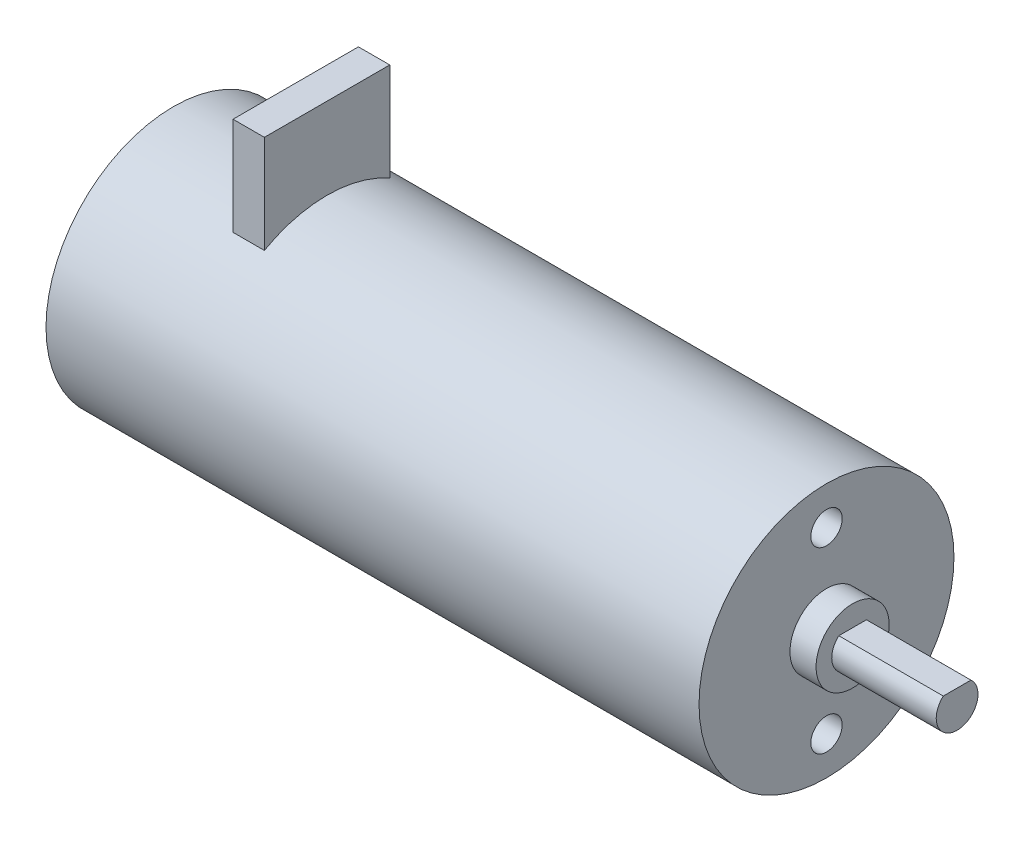
ISO-10303-21;
HEADER;
FILE_DESCRIPTION(('STEP AP214'),'2;1');
FILE_NAME('part.step','',(''),(''),'','','');
FILE_SCHEMA(('AUTOMOTIVE_DESIGN { 1 0 10303 214 1 1 1 1 }'));
ENDSEC;
DATA;
#1=APPLICATION_CONTEXT('core data for automotive mechanical design processes');
#2=APPLICATION_PROTOCOL_DEFINITION('international standard','automotive_design',2000,#1);
#3=PRODUCT_CONTEXT('',#1,'mechanical');
#4=PRODUCT('Part','Part','',(#3));
#5=PRODUCT_RELATED_PRODUCT_CATEGORY('part','',(#4));
#6=PRODUCT_DEFINITION_FORMATION('','',#4);
#7=PRODUCT_DEFINITION_CONTEXT('part definition',#1,'design');
#8=PRODUCT_DEFINITION('design','',#6,#7);
#9=PRODUCT_DEFINITION_SHAPE('','',#8);
#10=(LENGTH_UNIT() NAMED_UNIT(*) SI_UNIT(.MILLI.,.METRE.));
#11=(NAMED_UNIT(*) PLANE_ANGLE_UNIT() SI_UNIT($,.RADIAN.));
#12=(NAMED_UNIT(*) SI_UNIT($,.STERADIAN.) SOLID_ANGLE_UNIT());
#13=UNCERTAINTY_MEASURE_WITH_UNIT(LENGTH_MEASURE(1.E-05),#10,'distance_accuracy_value','');
#14=(GEOMETRIC_REPRESENTATION_CONTEXT(3) GLOBAL_UNCERTAINTY_ASSIGNED_CONTEXT((#13)) GLOBAL_UNIT_ASSIGNED_CONTEXT((#10,
#11,#12)) REPRESENTATION_CONTEXT('',''));
#15=CARTESIAN_POINT('',(0.,0.,0.));
#16=DIRECTION('',(0.,0.,1.));
#17=DIRECTION('',(1.,0.,0.));
#18=AXIS2_PLACEMENT_3D('',#15,#16,#17);
#19=CARTESIAN_POINT('',(62.5,0.,0.));
#20=DIRECTION('',(-1.,0.,0.));
#21=DIRECTION('',(0.,0.,1.));
#22=AXIS2_PLACEMENT_3D('',#19,#20,#21);
#23=CYLINDRICAL_SURFACE('',#22,12.2);
#24=CARTESIAN_POINT('',(0.,0.,0.));
#25=DIRECTION('',(1.,0.,0.));
#26=DIRECTION('',(0.,0.,-1.));
#27=AXIS2_PLACEMENT_3D('',#24,#25,#26);
#28=CIRCLE('',#27,12.2);
#29=CARTESIAN_POINT('',(0.,0.,-12.2));
#30=VERTEX_POINT('',#29);
#31=EDGE_CURVE('E143',#30,#30,#28,.T.);
#32=ORIENTED_EDGE('',*,*,#31,.T.);
#33=EDGE_LOOP('',(#32));
#34=FACE_BOUND('',#33,.T.);
#35=CARTESIAN_POINT('',(62.5,0.,0.));
#36=DIRECTION('',(1.,0.,0.));
#37=DIRECTION('',(0.,0.,-1.));
#38=AXIS2_PLACEMENT_3D('',#35,#36,#37);
#39=CIRCLE('',#38,12.2);
#40=CARTESIAN_POINT('',(62.5,0.,-12.2));
#41=VERTEX_POINT('',#40);
#42=EDGE_CURVE('E148',#41,#41,#39,.T.);
#43=ORIENTED_EDGE('',*,*,#42,.F.);
#44=EDGE_LOOP('',(#43));
#45=FACE_BOUND('',#44,.T.);
#46=CARTESIAN_POINT('',(11.7,0.,0.));
#47=DIRECTION('',(1.,0.,0.));
#48=DIRECTION('',(0.,0.,-1.));
#49=AXIS2_PLACEMENT_3D('',#46,#47,#48);
#50=CIRCLE('',#49,12.2);
#51=CARTESIAN_POINT('',(11.7,10.6226173799116,-6.));
#52=VERTEX_POINT('',#51);
#53=CARTESIAN_POINT('',(11.7,10.6226173799116,6.));
#54=VERTEX_POINT('',#53);
#55=EDGE_CURVE('E11',#52,#54,#50,.T.);
#56=ORIENTED_EDGE('',*,*,#55,.F.);
#57=DIRECTION('',(-1.,0.,0.));
#58=VECTOR('',#57,1.);
#59=CARTESIAN_POINT('',(62.5,10.6226173799116,-6.));
#60=LINE('',#59,#58);
#61=CARTESIAN_POINT('',(14.7,10.6226173799116,-6.));
#62=VERTEX_POINT('',#61);
#63=EDGE_CURVE('E147',#62,#52,#60,.T.);
#64=ORIENTED_EDGE('',*,*,#63,.F.);
#65=CARTESIAN_POINT('',(14.7,0.,0.));
#66=DIRECTION('',(-1.,0.,0.));
#67=DIRECTION('',(0.,0.,1.));
#68=AXIS2_PLACEMENT_3D('',#65,#66,#67);
#69=CIRCLE('',#68,12.2);
#70=CARTESIAN_POINT('',(14.7,10.6226173799116,6.));
#71=VERTEX_POINT('',#70);
#72=EDGE_CURVE('E54',#71,#62,#69,.T.);
#73=ORIENTED_EDGE('',*,*,#72,.F.);
#74=DIRECTION('',(-1.,0.,0.));
#75=VECTOR('',#74,1.);
#76=CARTESIAN_POINT('',(62.5,10.6226173799116,6.));
#77=LINE('',#76,#75);
#78=EDGE_CURVE('E44',#54,#71,#77,.F.);
#79=ORIENTED_EDGE('',*,*,#78,.F.);
#80=EDGE_LOOP('',(#56,#64,#73,#79));
#81=FACE_BOUND('',#80,.T.);
#82=ADVANCED_FACE('F37',(#34,#45,#81),#23,.T.);
#83=CARTESIAN_POINT('',(62.5,0.,0.));
#84=DIRECTION('',(1.,0.,0.));
#85=DIRECTION('',(0.,0.,-1.));
#86=AXIS2_PLACEMENT_3D('',#83,#84,#85);
#87=PLANE('',#86);
#88=CARTESIAN_POINT('',(62.5,8.55,0.));
#89=DIRECTION('',(1.,0.,0.));
#90=DIRECTION('',(0.,0.,-1.));
#91=AXIS2_PLACEMENT_3D('',#88,#89,#90);
#92=CIRCLE('',#91,1.5);
#93=CARTESIAN_POINT('',(62.5,8.55,-1.5));
#94=VERTEX_POINT('',#93);
#95=EDGE_CURVE('E119',#94,#94,#92,.T.);
#96=ORIENTED_EDGE('',*,*,#95,.F.);
#97=EDGE_LOOP('',(#96));
#98=FACE_BOUND('',#97,.T.);
#99=CARTESIAN_POINT('',(62.5,-8.55,0.));
#100=DIRECTION('',(1.,0.,0.));
#101=DIRECTION('',(0.,0.,1.));
#102=AXIS2_PLACEMENT_3D('',#99,#100,#101);
#103=CIRCLE('',#102,1.5);
#104=CARTESIAN_POINT('',(62.5,-8.55,1.5));
#105=VERTEX_POINT('',#104);
#106=EDGE_CURVE('E106',#105,#105,#103,.T.);
#107=ORIENTED_EDGE('',*,*,#106,.F.);
#108=EDGE_LOOP('',(#107));
#109=FACE_BOUND('',#108,.T.);
#110=CARTESIAN_POINT('',(62.5,0.,0.));
#111=DIRECTION('',(1.,0.,0.));
#112=DIRECTION('',(0.,0.,-1.));
#113=AXIS2_PLACEMENT_3D('',#110,#111,#112);
#114=CIRCLE('',#113,3.5);
#115=CARTESIAN_POINT('',(62.5,0.,-3.5));
#116=VERTEX_POINT('',#115);
#117=EDGE_CURVE('E144',#116,#116,#114,.T.);
#118=ORIENTED_EDGE('',*,*,#117,.F.);
#119=EDGE_LOOP('',(#118));
#120=FACE_BOUND('',#119,.T.);
#121=ORIENTED_EDGE('',*,*,#42,.T.);
#122=EDGE_LOOP('',(#121));
#123=FACE_BOUND('',#122,.T.);
#124=ADVANCED_FACE('F166',(#98,#109,#120,#123),#87,.T.);
#125=CARTESIAN_POINT('',(0.,0.,0.));
#126=DIRECTION('',(1.,0.,0.));
#127=DIRECTION('',(0.,0.,-1.));
#128=AXIS2_PLACEMENT_3D('',#125,#126,#127);
#129=PLANE('',#128);
#130=ORIENTED_EDGE('',*,*,#31,.F.);
#131=EDGE_LOOP('',(#130));
#132=FACE_BOUND('',#131,.T.);
#133=ADVANCED_FACE('F171',(#132),#129,.F.);
#134=CARTESIAN_POINT('',(65.,0.,0.));
#135=DIRECTION('',(-1.,0.,0.));
#136=DIRECTION('',(0.,0.,1.));
#137=AXIS2_PLACEMENT_3D('',#134,#135,#136);
#138=CYLINDRICAL_SURFACE('',#137,3.5);
#139=CARTESIAN_POINT('',(65.,0.,0.));
#140=DIRECTION('',(1.,0.,0.));
#141=DIRECTION('',(0.,0.,-1.));
#142=AXIS2_PLACEMENT_3D('',#139,#140,#141);
#143=CIRCLE('',#142,3.5);
#144=CARTESIAN_POINT('',(65.,0.,-3.5));
#145=VERTEX_POINT('',#144);
#146=EDGE_CURVE('E140',#145,#145,#143,.T.);
#147=ORIENTED_EDGE('',*,*,#146,.F.);
#148=EDGE_LOOP('',(#147));
#149=FACE_BOUND('',#148,.T.);
#150=ORIENTED_EDGE('',*,*,#117,.T.);
#151=EDGE_LOOP('',(#150));
#152=FACE_BOUND('',#151,.T.);
#153=ADVANCED_FACE('F180',(#149,#152),#138,.T.);
#154=CARTESIAN_POINT('',(65.,0.,0.));
#155=DIRECTION('',(1.,0.,0.));
#156=DIRECTION('',(0.,0.,-1.));
#157=AXIS2_PLACEMENT_3D('',#154,#155,#156);
#158=PLANE('',#157);
#159=CARTESIAN_POINT('',(65.,0.,0.));
#160=DIRECTION('',(1.,0.,0.));
#161=DIRECTION('',(0.,0.,-1.));
#162=AXIS2_PLACEMENT_3D('',#159,#160,#161);
#163=CIRCLE('',#162,2.);
#164=CARTESIAN_POINT('',(65.,1.5,1.3228756555323));
#165=VERTEX_POINT('',#164);
#166=CARTESIAN_POINT('',(65.,1.5,-1.3228756555323));
#167=VERTEX_POINT('',#166);
#168=EDGE_CURVE('E118',#165,#167,#163,.T.);
#169=ORIENTED_EDGE('',*,*,#168,.F.);
#170=DIRECTION('',(0.,0.,1.));
#171=VECTOR('',#170,1.);
#172=CARTESIAN_POINT('',(65.,1.5,1.3228756555323));
#173=LINE('',#172,#171);
#174=EDGE_CURVE('E128',#167,#165,#173,.T.);
#175=ORIENTED_EDGE('',*,*,#174,.F.);
#176=EDGE_LOOP('',(#169,#175));
#177=FACE_BOUND('',#176,.T.);
#178=ORIENTED_EDGE('',*,*,#146,.T.);
#179=EDGE_LOOP('',(#178));
#180=FACE_BOUND('',#179,.T.);
#181=ADVANCED_FACE('F184',(#177,#180),#158,.T.);
#182=CARTESIAN_POINT('',(75.,0.,0.));
#183=DIRECTION('',(-1.,0.,0.));
#184=DIRECTION('',(0.,0.,1.));
#185=AXIS2_PLACEMENT_3D('',#182,#183,#184);
#186=CYLINDRICAL_SURFACE('',#185,2.);
#187=ORIENTED_EDGE('',*,*,#168,.T.);
#188=DIRECTION('',(-1.,0.,0.));
#189=VECTOR('',#188,1.);
#190=CARTESIAN_POINT('',(75.,1.5,-1.3228756555323));
#191=LINE('',#190,#189);
#192=CARTESIAN_POINT('',(75.,1.5,-1.3228756555323));
#193=VERTEX_POINT('',#192);
#194=EDGE_CURVE('E137',#193,#167,#191,.T.);
#195=ORIENTED_EDGE('',*,*,#194,.F.);
#196=CARTESIAN_POINT('',(75.,0.,0.));
#197=DIRECTION('',(1.,0.,0.));
#198=DIRECTION('',(0.,0.,-1.));
#199=AXIS2_PLACEMENT_3D('',#196,#197,#198);
#200=CIRCLE('',#199,2.);
#201=CARTESIAN_POINT('',(75.,1.5,1.3228756555323));
#202=VERTEX_POINT('',#201);
#203=EDGE_CURVE('E124',#202,#193,#200,.T.);
#204=ORIENTED_EDGE('',*,*,#203,.F.);
#205=DIRECTION('',(-1.,0.,0.));
#206=VECTOR('',#205,1.);
#207=CARTESIAN_POINT('',(75.,1.5,1.3228756555323));
#208=LINE('',#207,#206);
#209=EDGE_CURVE('E130',#202,#165,#208,.T.);
#210=ORIENTED_EDGE('',*,*,#209,.T.);
#211=EDGE_LOOP('',(#187,#195,#204,#210));
#212=FACE_BOUND('',#211,.T.);
#213=ADVANCED_FACE('F190',(#212),#186,.T.);
#214=CARTESIAN_POINT('',(75.,1.5,1.3228756555323));
#215=DIRECTION('',(0.,-1.,0.));
#216=DIRECTION('',(0.,0.,-1.));
#217=AXIS2_PLACEMENT_3D('',#214,#215,#216);
#218=PLANE('',#217);
#219=ORIENTED_EDGE('',*,*,#174,.T.);
#220=ORIENTED_EDGE('',*,*,#209,.F.);
#221=DIRECTION('',(0.,0.,1.));
#222=VECTOR('',#221,1.);
#223=CARTESIAN_POINT('',(75.,1.5,1.3228756555323));
#224=LINE('',#223,#222);
#225=EDGE_CURVE('E127',#193,#202,#224,.T.);
#226=ORIENTED_EDGE('',*,*,#225,.F.);
#227=ORIENTED_EDGE('',*,*,#194,.T.);
#228=EDGE_LOOP('',(#219,#220,#226,#227));
#229=FACE_BOUND('',#228,.T.);
#230=ADVANCED_FACE('F194',(#229),#218,.F.);
#231=CARTESIAN_POINT('',(75.,0.,0.));
#232=DIRECTION('',(1.,0.,0.));
#233=DIRECTION('',(0.,0.,-1.));
#234=AXIS2_PLACEMENT_3D('',#231,#232,#233);
#235=PLANE('',#234);
#236=ORIENTED_EDGE('',*,*,#203,.T.);
#237=ORIENTED_EDGE('',*,*,#225,.T.);
#238=EDGE_LOOP('',(#236,#237));
#239=FACE_BOUND('',#238,.T.);
#240=ADVANCED_FACE('F198',(#239),#235,.T.);
#241=CARTESIAN_POINT('',(57.5,-8.55,0.));
#242=DIRECTION('',(1.,0.,0.));
#243=DIRECTION('',(0.,0.,-1.));
#244=AXIS2_PLACEMENT_3D('',#241,#242,#243);
#245=CYLINDRICAL_SURFACE('',#244,1.5);
#246=CARTESIAN_POINT('',(57.5,-8.55,0.));
#247=DIRECTION('',(1.,0.,0.));
#248=DIRECTION('',(0.,0.,1.));
#249=AXIS2_PLACEMENT_3D('',#246,#247,#248);
#250=CIRCLE('',#249,1.5);
#251=CARTESIAN_POINT('',(57.5,-8.55,1.5));
#252=VERTEX_POINT('',#251);
#253=EDGE_CURVE('E109',#252,#252,#250,.T.);
#254=ORIENTED_EDGE('',*,*,#253,.F.);
#255=EDGE_LOOP('',(#254));
#256=FACE_BOUND('',#255,.T.);
#257=ORIENTED_EDGE('',*,*,#106,.T.);
#258=EDGE_LOOP('',(#257));
#259=FACE_BOUND('',#258,.T.);
#260=ADVANCED_FACE('F202',(#256,#259),#245,.F.);
#261=CARTESIAN_POINT('',(57.5,-8.55,0.));
#262=DIRECTION('',(-1.,0.,0.));
#263=DIRECTION('',(0.,0.,1.));
#264=AXIS2_PLACEMENT_3D('',#261,#262,#263);
#265=PLANE('',#264);
#266=ORIENTED_EDGE('',*,*,#253,.T.);
#267=EDGE_LOOP('',(#266));
#268=FACE_BOUND('',#267,.T.);
#269=ADVANCED_FACE('F206',(#268),#265,.F.);
#270=CARTESIAN_POINT('',(57.5,8.55,0.));
#271=DIRECTION('',(1.,0.,0.));
#272=DIRECTION('',(0.,0.,-1.));
#273=AXIS2_PLACEMENT_3D('',#270,#271,#272);
#274=CYLINDRICAL_SURFACE('',#273,1.5);
#275=CARTESIAN_POINT('',(57.5,8.55,0.));
#276=DIRECTION('',(1.,0.,0.));
#277=DIRECTION('',(0.,0.,-1.));
#278=AXIS2_PLACEMENT_3D('',#275,#276,#277);
#279=CIRCLE('',#278,1.5);
#280=CARTESIAN_POINT('',(57.5,8.55,-1.5));
#281=VERTEX_POINT('',#280);
#282=EDGE_CURVE('E115',#281,#281,#279,.T.);
#283=ORIENTED_EDGE('',*,*,#282,.F.);
#284=EDGE_LOOP('',(#283));
#285=FACE_BOUND('',#284,.T.);
#286=ORIENTED_EDGE('',*,*,#95,.T.);
#287=EDGE_LOOP('',(#286));
#288=FACE_BOUND('',#287,.T.);
#289=ADVANCED_FACE('F210',(#285,#288),#274,.F.);
#290=CARTESIAN_POINT('',(57.5,8.55,0.));
#291=DIRECTION('',(1.,0.,0.));
#292=DIRECTION('',(0.,0.,-1.));
#293=AXIS2_PLACEMENT_3D('',#290,#291,#292);
#294=PLANE('',#293);
#295=ORIENTED_EDGE('',*,*,#282,.T.);
#296=EDGE_LOOP('',(#295));
#297=FACE_BOUND('',#296,.T.);
#298=ADVANCED_FACE('F214',(#297),#294,.T.);
#299=CARTESIAN_POINT('',(11.7,20.,6.));
#300=DIRECTION('',(0.,0.,-1.));
#301=DIRECTION('',(-1.,0.,0.));
#302=AXIS2_PLACEMENT_3D('',#299,#300,#301);
#303=PLANE('',#302);
#304=DIRECTION('',(0.,-1.,0.));
#305=VECTOR('',#304,1.);
#306=CARTESIAN_POINT('',(11.7,20.,6.));
#307=LINE('',#306,#305);
#308=CARTESIAN_POINT('',(11.7,20.,6.));
#309=VERTEX_POINT('',#308);
#310=EDGE_CURVE('E89',#309,#54,#307,.T.);
#311=ORIENTED_EDGE('',*,*,#310,.T.);
#312=ORIENTED_EDGE('',*,*,#78,.T.);
#313=DIRECTION('',(0.,-1.,0.));
#314=VECTOR('',#313,1.);
#315=CARTESIAN_POINT('',(14.7,20.,6.));
#316=LINE('',#315,#314);
#317=CARTESIAN_POINT('',(14.7,20.,6.));
#318=VERTEX_POINT('',#317);
#319=EDGE_CURVE('E91',#318,#71,#316,.T.);
#320=ORIENTED_EDGE('',*,*,#319,.F.);
#321=DIRECTION('',(1.,0.,0.));
#322=VECTOR('',#321,1.);
#323=CARTESIAN_POINT('',(11.7,20.,6.));
#324=LINE('',#323,#322);
#325=EDGE_CURVE('E85',#309,#318,#324,.T.);
#326=ORIENTED_EDGE('',*,*,#325,.F.);
#327=EDGE_LOOP('',(#311,#312,#320,#326));
#328=FACE_BOUND('',#327,.T.);
#329=ADVANCED_FACE('F87',(#328),#303,.F.);
#330=CARTESIAN_POINT('',(11.7,20.,-6.));
#331=DIRECTION('',(0.,0.,1.));
#332=DIRECTION('',(1.,0.,0.));
#333=AXIS2_PLACEMENT_3D('',#330,#331,#332);
#334=PLANE('',#333);
#335=DIRECTION('',(0.,-1.,0.));
#336=VECTOR('',#335,1.);
#337=CARTESIAN_POINT('',(14.7,20.,-6.));
#338=LINE('',#337,#336);
#339=CARTESIAN_POINT('',(14.7,20.,-6.));
#340=VERTEX_POINT('',#339);
#341=EDGE_CURVE('E111',#340,#62,#338,.T.);
#342=ORIENTED_EDGE('',*,*,#341,.T.);
#343=ORIENTED_EDGE('',*,*,#63,.T.);
#344=DIRECTION('',(0.,-1.,0.));
#345=VECTOR('',#344,1.);
#346=CARTESIAN_POINT('',(11.7,20.,-6.));
#347=LINE('',#346,#345);
#348=CARTESIAN_POINT('',(11.7,20.,-6.));
#349=VERTEX_POINT('',#348);
#350=EDGE_CURVE('E160',#349,#52,#347,.T.);
#351=ORIENTED_EDGE('',*,*,#350,.F.);
#352=DIRECTION('',(-1.,0.,0.));
#353=VECTOR('',#352,1.);
#354=CARTESIAN_POINT('',(11.7,20.,-6.));
#355=LINE('',#354,#353);
#356=EDGE_CURVE('E100',#340,#349,#355,.T.);
#357=ORIENTED_EDGE('',*,*,#356,.F.);
#358=EDGE_LOOP('',(#342,#343,#351,#357));
#359=FACE_BOUND('',#358,.T.);
#360=ADVANCED_FACE('F164',(#359),#334,.F.);
#361=CARTESIAN_POINT('',(11.7,20.,-6.));
#362=DIRECTION('',(1.,0.,0.));
#363=DIRECTION('',(0.,0.,-1.));
#364=AXIS2_PLACEMENT_3D('',#361,#362,#363);
#365=PLANE('',#364);
#366=ORIENTED_EDGE('',*,*,#350,.T.);
#367=ORIENTED_EDGE('',*,*,#55,.T.);
#368=ORIENTED_EDGE('',*,*,#310,.F.);
#369=DIRECTION('',(0.,0.,1.));
#370=VECTOR('',#369,1.);
#371=CARTESIAN_POINT('',(11.7,20.,-6.));
#372=LINE('',#371,#370);
#373=EDGE_CURVE('E95',#349,#309,#372,.T.);
#374=ORIENTED_EDGE('',*,*,#373,.F.);
#375=EDGE_LOOP('',(#366,#367,#368,#374));
#376=FACE_BOUND('',#375,.T.);
#377=ADVANCED_FACE('F105',(#376),#365,.F.);
#378=CARTESIAN_POINT('',(14.7,20.,-6.));
#379=DIRECTION('',(-1.,0.,0.));
#380=DIRECTION('',(0.,0.,1.));
#381=AXIS2_PLACEMENT_3D('',#378,#379,#380);
#382=PLANE('',#381);
#383=ORIENTED_EDGE('',*,*,#319,.T.);
#384=ORIENTED_EDGE('',*,*,#72,.T.);
#385=ORIENTED_EDGE('',*,*,#341,.F.);
#386=DIRECTION('',(0.,0.,-1.));
#387=VECTOR('',#386,1.);
#388=CARTESIAN_POINT('',(14.7,20.,-6.));
#389=LINE('',#388,#387);
#390=EDGE_CURVE('E94',#318,#340,#389,.T.);
#391=ORIENTED_EDGE('',*,*,#390,.F.);
#392=EDGE_LOOP('',(#383,#384,#385,#391));
#393=FACE_BOUND('',#392,.T.);
#394=ADVANCED_FACE('F156',(#393),#382,.F.);
#395=CARTESIAN_POINT('',(0.,20.,0.));
#396=DIRECTION('',(0.,1.,0.));
#397=DIRECTION('',(0.,0.,1.));
#398=AXIS2_PLACEMENT_3D('',#395,#396,#397);
#399=PLANE('',#398);
#400=ORIENTED_EDGE('',*,*,#373,.T.);
#401=ORIENTED_EDGE('',*,*,#325,.T.);
#402=ORIENTED_EDGE('',*,*,#390,.T.);
#403=ORIENTED_EDGE('',*,*,#356,.T.);
#404=EDGE_LOOP('',(#400,#401,#402,#403));
#405=FACE_BOUND('',#404,.T.);
#406=ADVANCED_FACE('F98',(#405),#399,.T.);
#407=CLOSED_SHELL('',(#82,#124,#133,#153,#181,#213,#230,#240,#260,#269,#289,#298,#329,#360,#377,
#394,#406));
#408=MANIFOLD_SOLID_BREP('B2',#407);
#409=ADVANCED_BREP_SHAPE_REPRESENTATION('',(#18,#408),#14);
#410=SHAPE_DEFINITION_REPRESENTATION(#9,#409);
ENDSEC;
END-ISO-10303-21;
